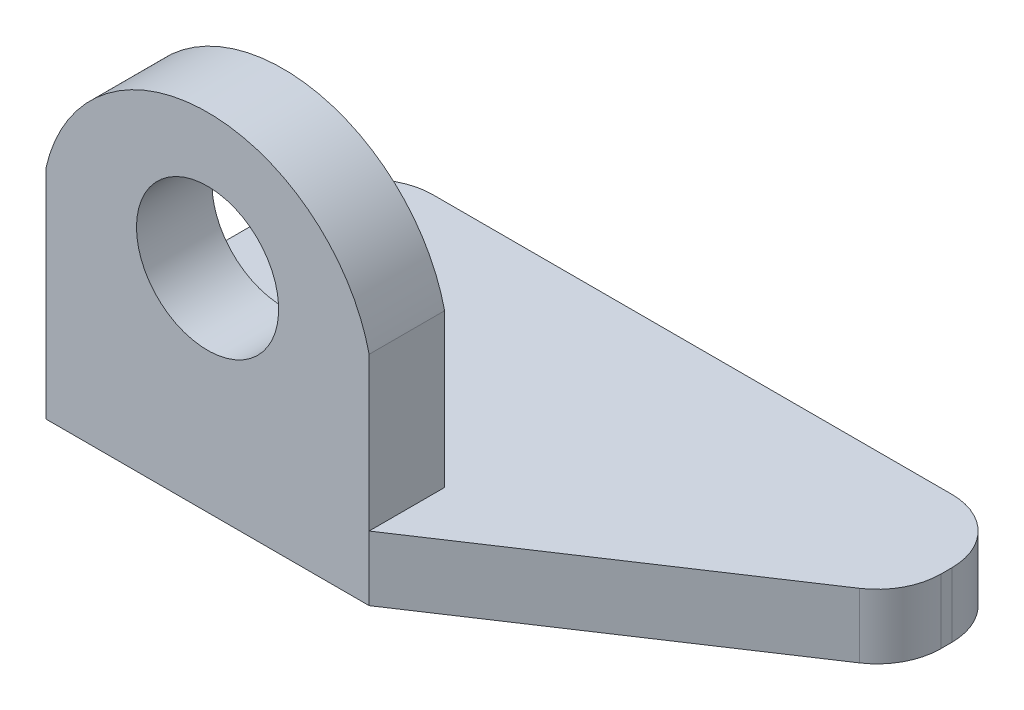
ISO-10303-21;
HEADER;
FILE_DESCRIPTION(('STEP AP214'),'2;1');
FILE_NAME('part.step','',(''),(''),'','','');
FILE_SCHEMA(('AUTOMOTIVE_DESIGN { 1 0 10303 214 1 1 1 1 }'));
ENDSEC;
DATA;
#1=APPLICATION_CONTEXT('core data for automotive mechanical design processes');
#2=APPLICATION_PROTOCOL_DEFINITION('international standard','automotive_design',2000,#1);
#3=PRODUCT_CONTEXT('',#1,'mechanical');
#4=PRODUCT('Part','Part','',(#3));
#5=PRODUCT_RELATED_PRODUCT_CATEGORY('part','',(#4));
#6=PRODUCT_DEFINITION_FORMATION('','',#4);
#7=PRODUCT_DEFINITION_CONTEXT('part definition',#1,'design');
#8=PRODUCT_DEFINITION('design','',#6,#7);
#9=PRODUCT_DEFINITION_SHAPE('','',#8);
#10=(LENGTH_UNIT() NAMED_UNIT(*) SI_UNIT(.MILLI.,.METRE.));
#11=(NAMED_UNIT(*) PLANE_ANGLE_UNIT() SI_UNIT($,.RADIAN.));
#12=(NAMED_UNIT(*) SI_UNIT($,.STERADIAN.) SOLID_ANGLE_UNIT());
#13=UNCERTAINTY_MEASURE_WITH_UNIT(LENGTH_MEASURE(1.E-05),#10,'distance_accuracy_value','');
#14=(GEOMETRIC_REPRESENTATION_CONTEXT(3) GLOBAL_UNCERTAINTY_ASSIGNED_CONTEXT((#13)) GLOBAL_UNIT_ASSIGNED_CONTEXT((#10,
#11,#12)) REPRESENTATION_CONTEXT('',''));
#15=CARTESIAN_POINT('',(0.,0.,0.));
#16=DIRECTION('',(0.,0.,1.));
#17=DIRECTION('',(1.,0.,0.));
#18=AXIS2_PLACEMENT_3D('',#15,#16,#17);
#19=CARTESIAN_POINT('',(0.,10.16,0.));
#20=DIRECTION('',(0.,1.,0.));
#21=DIRECTION('',(0.,0.,1.));
#22=AXIS2_PLACEMENT_3D('',#19,#20,#21);
#23=PLANE('',#22);
#24=DIRECTION('',(1.,0.,0.));
#25=VECTOR('',#24,1.);
#26=CARTESIAN_POINT('',(0.,10.16,-38.9370998116761));
#27=LINE('',#26,#25);
#28=CARTESIAN_POINT('',(-53.4459299037248,10.16,-38.9370998116761));
#29=VERTEX_POINT('',#28);
#30=CARTESIAN_POINT('',(28.1540700962752,10.16,-38.9370998116761));
#31=VERTEX_POINT('',#30);
#32=EDGE_CURVE('E162',#29,#31,#27,.T.);
#33=ORIENTED_EDGE('',*,*,#32,.F.);
#34=CARTESIAN_POINT('',(-53.4459299037248,10.16,-28.9370998116761));
#35=DIRECTION('',(0.,1.,0.));
#36=DIRECTION('',(0.,0.,1.));
#37=AXIS2_PLACEMENT_3D('',#34,#35,#36);
#38=CIRCLE('',#37,10.);
#39=CARTESIAN_POINT('',(-63.4459299037248,10.16,-28.9370998116761));
#40=VERTEX_POINT('',#39);
#41=EDGE_CURVE('E11',#29,#40,#38,.T.);
#42=ORIENTED_EDGE('',*,*,#41,.T.);
#43=DIRECTION('',(0.,0.,-1.));
#44=VECTOR('',#43,1.);
#45=CARTESIAN_POINT('',(-63.4459299037248,10.16,0.));
#46=LINE('',#45,#44);
#47=CARTESIAN_POINT('',(-63.4459299037248,10.16,0.));
#48=VERTEX_POINT('',#47);
#49=EDGE_CURVE('E123',#48,#40,#46,.T.);
#50=ORIENTED_EDGE('',*,*,#49,.F.);
#51=DIRECTION('',(1.,0.,0.));
#52=VECTOR('',#51,1.);
#53=CARTESIAN_POINT('',(0.,10.16,0.));
#54=LINE('',#53,#52);
#55=CARTESIAN_POINT('',(-12.6459299037248,10.16,0.));
#56=VERTEX_POINT('',#55);
#57=EDGE_CURVE('E133',#48,#56,#54,.T.);
#58=ORIENTED_EDGE('',*,*,#57,.T.);
#59=DIRECTION('',(0.,0.,-1.));
#60=VECTOR('',#59,1.);
#61=CARTESIAN_POINT('',(-12.6459299037248,10.16,79.2752736150791));
#62=LINE('',#61,#60);
#63=CARTESIAN_POINT('',(-12.6459299037248,10.16,11.8629001883239));
#64=VERTEX_POINT('',#63);
#65=EDGE_CURVE('E152',#64,#56,#62,.T.);
#66=ORIENTED_EDGE('',*,*,#65,.F.);
#67=DIRECTION('',(0.833279049312413,0.,-0.552852625911284));
#68=VECTOR('',#67,1.);
#69=CARTESIAN_POINT('',(1.59982869525708,10.16,2.41131844503613));
#70=LINE('',#69,#68);
#71=CARTESIAN_POINT('',(33.682596355388,10.16,-18.8745189488607));
#72=VERTEX_POINT('',#71);
#73=EDGE_CURVE('E156',#64,#72,#70,.T.);
#74=ORIENTED_EDGE('',*,*,#73,.T.);
#75=CARTESIAN_POINT('',(28.1540700962752,10.16,-27.2073094419849));
#76=DIRECTION('',(0.,1.,0.));
#77=DIRECTION('',(0.,0.,1.));
#78=AXIS2_PLACEMENT_3D('',#75,#76,#77);
#79=CIRCLE('',#78,10.);
#80=CARTESIAN_POINT('',(38.1540700962752,10.16,-27.2073094419849));
#81=VERTEX_POINT('',#80);
#82=EDGE_CURVE('E193',#72,#81,#79,.T.);
#83=ORIENTED_EDGE('',*,*,#82,.T.);
#84=DIRECTION('',(0.,0.,1.));
#85=VECTOR('',#84,1.);
#86=CARTESIAN_POINT('',(38.1540700962752,10.16,0.));
#87=LINE('',#86,#85);
#88=CARTESIAN_POINT('',(38.1540700962752,10.16,-28.9370998116761));
#89=VERTEX_POINT('',#88);
#90=EDGE_CURVE('E159',#89,#81,#87,.T.);
#91=ORIENTED_EDGE('',*,*,#90,.F.);
#92=CARTESIAN_POINT('',(28.1540700962752,10.16,-28.9370998116761));
#93=DIRECTION('',(0.,1.,0.));
#94=DIRECTION('',(0.,0.,1.));
#95=AXIS2_PLACEMENT_3D('',#92,#93,#94);
#96=CIRCLE('',#95,10.);
#97=EDGE_CURVE('E183',#89,#31,#96,.T.);
#98=ORIENTED_EDGE('',*,*,#97,.T.);
#99=EDGE_LOOP('',(#33,#42,#50,#58,#66,#74,#83,#91,#98));
#100=FACE_BOUND('',#99,.T.);
#101=ADVANCED_FACE('F32',(#100),#23,.T.);
#102=CARTESIAN_POINT('',(0.,10.16,11.8629001883239));
#103=DIRECTION('',(0.,0.,1.));
#104=DIRECTION('',(1.,0.,0.));
#105=AXIS2_PLACEMENT_3D('',#102,#103,#104);
#106=PLANE('',#105);
#107=CARTESIAN_POINT('',(-38.0459299037249,33.2379234900602,11.8629001883239));
#108=DIRECTION('',(0.,0.,-1.));
#109=DIRECTION('',(-1.,0.,0.));
#110=AXIS2_PLACEMENT_3D('',#107,#108,#109);
#111=CIRCLE('',#110,11.176966961914);
#112=CARTESIAN_POINT('',(-49.2228968656389,33.2379234900602,11.8629001883239));
#113=VERTEX_POINT('',#112);
#114=EDGE_CURVE('E140',#113,#113,#111,.T.);
#115=ORIENTED_EDGE('',*,*,#114,.T.);
#116=EDGE_LOOP('',(#115));
#117=FACE_BOUND('',#116,.T.);
#118=DIRECTION('',(-1.,0.,0.));
#119=VECTOR('',#118,1.);
#120=CARTESIAN_POINT('',(0.,0.,11.8629001883239));
#121=LINE('',#120,#119);
#122=CARTESIAN_POINT('',(-12.6459299037248,0.,11.8629001883239));
#123=VERTEX_POINT('',#122);
#124=CARTESIAN_POINT('',(-63.4459299037248,0.,11.8629001883239));
#125=VERTEX_POINT('',#124);
#126=EDGE_CURVE('E149',#123,#125,#121,.T.);
#127=ORIENTED_EDGE('',*,*,#126,.F.);
#128=DIRECTION('',(0.,-1.,0.));
#129=VECTOR('',#128,1.);
#130=CARTESIAN_POINT('',(-12.6459299037248,10.16,11.8629001883239));
#131=LINE('',#130,#129);
#132=EDGE_CURVE('E122',#64,#123,#131,.T.);
#133=ORIENTED_EDGE('',*,*,#132,.F.);
#134=DIRECTION('',(0.,1.,0.));
#135=VECTOR('',#134,1.);
#136=CARTESIAN_POINT('',(-12.6459299037248,0.,11.8629001883239));
#137=LINE('',#136,#135);
#138=CARTESIAN_POINT('',(-12.6459299037248,34.2244860125212,11.8629001883239));
#139=VERTEX_POINT('',#138);
#140=EDGE_CURVE('E139',#64,#139,#137,.T.);
#141=ORIENTED_EDGE('',*,*,#140,.T.);
#142=CARTESIAN_POINT('',(-38.0459299037248,28.4198188154215,11.8629001883239));
#143=DIRECTION('',(0.,0.,1.));
#144=DIRECTION('',(1.,0.,0.));
#145=AXIS2_PLACEMENT_3D('',#142,#143,#144);
#146=CIRCLE('',#145,26.0548299029006);
#147=CARTESIAN_POINT('',(-63.4459299037248,34.2244860125212,11.8629001883239));
#148=VERTEX_POINT('',#147);
#149=EDGE_CURVE('E128',#148,#139,#146,.F.);
#150=ORIENTED_EDGE('',*,*,#149,.F.);
#151=DIRECTION('',(0.,-1.,0.));
#152=VECTOR('',#151,1.);
#153=CARTESIAN_POINT('',(-63.4459299037248,10.16,11.8629001883239));
#154=LINE('',#153,#152);
#155=EDGE_CURVE('E109',#148,#125,#154,.T.);
#156=ORIENTED_EDGE('',*,*,#155,.T.);
#157=EDGE_LOOP('',(#127,#133,#141,#150,#156));
#158=FACE_BOUND('',#157,.T.);
#159=ADVANCED_FACE('F136',(#117,#158),#106,.T.);
#160=CARTESIAN_POINT('',(1.59982869525708,10.16,2.41131844503613));
#161=DIRECTION('',(-0.552852625911284,0.,-0.833279049312413));
#162=DIRECTION('',(-0.833279049312413,0.,0.552852625911284));
#163=AXIS2_PLACEMENT_3D('',#160,#161,#162);
#164=PLANE('',#163);
#165=DIRECTION('',(0.833279049312413,0.,-0.552852625911284));
#166=VECTOR('',#165,1.);
#167=CARTESIAN_POINT('',(1.59982869525708,0.,2.41131844503613));
#168=LINE('',#167,#166);
#169=CARTESIAN_POINT('',(33.682596355388,0.,-18.8745189488607));
#170=VERTEX_POINT('',#169);
#171=EDGE_CURVE('E166',#123,#170,#168,.T.);
#172=ORIENTED_EDGE('',*,*,#171,.T.);
#173=DIRECTION('',(0.,-1.,0.));
#174=VECTOR('',#173,1.);
#175=CARTESIAN_POINT('',(33.682596355388,10.16,-18.8745189488607));
#176=LINE('',#175,#174);
#177=EDGE_CURVE('E191',#170,#72,#176,.F.);
#178=ORIENTED_EDGE('',*,*,#177,.T.);
#179=ORIENTED_EDGE('',*,*,#73,.F.);
#180=ORIENTED_EDGE('',*,*,#132,.T.);
#181=EDGE_LOOP('',(#172,#178,#179,#180));
#182=FACE_BOUND('',#181,.T.);
#183=ADVANCED_FACE('F204',(#182),#164,.F.);
#184=CARTESIAN_POINT('',(38.1540700962752,10.16,0.));
#185=DIRECTION('',(1.,0.,0.));
#186=DIRECTION('',(0.,0.,-1.));
#187=AXIS2_PLACEMENT_3D('',#184,#185,#186);
#188=PLANE('',#187);
#189=ORIENTED_EDGE('',*,*,#90,.T.);
#190=DIRECTION('',(0.,-1.,0.));
#191=VECTOR('',#190,1.);
#192=CARTESIAN_POINT('',(38.1540700962752,0.,-27.2073094419849));
#193=LINE('',#192,#191);
#194=CARTESIAN_POINT('',(38.1540700962752,0.,-27.2073094419849));
#195=VERTEX_POINT('',#194);
#196=EDGE_CURVE('E186',#81,#195,#193,.T.);
#197=ORIENTED_EDGE('',*,*,#196,.T.);
#198=DIRECTION('',(0.,0.,1.));
#199=VECTOR('',#198,1.);
#200=CARTESIAN_POINT('',(38.1540700962752,0.,0.));
#201=LINE('',#200,#199);
#202=CARTESIAN_POINT('',(38.1540700962752,0.,-28.9370998116761));
#203=VERTEX_POINT('',#202);
#204=EDGE_CURVE('E169',#203,#195,#201,.T.);
#205=ORIENTED_EDGE('',*,*,#204,.F.);
#206=DIRECTION('',(0.,-1.,0.));
#207=VECTOR('',#206,1.);
#208=CARTESIAN_POINT('',(38.1540700962752,10.16,-28.9370998116761));
#209=LINE('',#208,#207);
#210=EDGE_CURVE('E181',#203,#89,#209,.F.);
#211=ORIENTED_EDGE('',*,*,#210,.T.);
#212=EDGE_LOOP('',(#189,#197,#205,#211));
#213=FACE_BOUND('',#212,.T.);
#214=ADVANCED_FACE('F249',(#213),#188,.T.);
#215=CARTESIAN_POINT('',(0.,10.16,-38.9370998116761));
#216=DIRECTION('',(0.,0.,-1.));
#217=DIRECTION('',(-1.,0.,0.));
#218=AXIS2_PLACEMENT_3D('',#215,#216,#217);
#219=PLANE('',#218);
#220=DIRECTION('',(1.,0.,0.));
#221=VECTOR('',#220,1.);
#222=CARTESIAN_POINT('',(0.,0.,-38.9370998116761));
#223=LINE('',#222,#221);
#224=CARTESIAN_POINT('',(-53.4459299037248,0.,-38.9370998116761));
#225=VERTEX_POINT('',#224);
#226=CARTESIAN_POINT('',(28.1540700962752,0.,-38.9370998116761));
#227=VERTEX_POINT('',#226);
#228=EDGE_CURVE('E172',#225,#227,#223,.T.);
#229=ORIENTED_EDGE('',*,*,#228,.F.);
#230=DIRECTION('',(0.,-1.,0.));
#231=VECTOR('',#230,1.);
#232=CARTESIAN_POINT('',(-53.4459299037248,10.16,-38.9370998116761));
#233=LINE('',#232,#231);
#234=EDGE_CURVE('E40',#225,#29,#233,.F.);
#235=ORIENTED_EDGE('',*,*,#234,.T.);
#236=ORIENTED_EDGE('',*,*,#32,.T.);
#237=DIRECTION('',(0.,-1.,0.));
#238=VECTOR('',#237,1.);
#239=CARTESIAN_POINT('',(28.1540700962752,10.16,-38.9370998116761));
#240=LINE('',#239,#238);
#241=EDGE_CURVE('E176',#31,#227,#240,.T.);
#242=ORIENTED_EDGE('',*,*,#241,.T.);
#243=EDGE_LOOP('',(#229,#235,#236,#242));
#244=FACE_BOUND('',#243,.T.);
#245=ADVANCED_FACE('F246',(#244),#219,.T.);
#246=CARTESIAN_POINT('',(-63.4459299037248,10.16,0.));
#247=DIRECTION('',(-1.,0.,0.));
#248=DIRECTION('',(0.,0.,1.));
#249=AXIS2_PLACEMENT_3D('',#246,#247,#248);
#250=PLANE('',#249);
#251=ORIENTED_EDGE('',*,*,#49,.T.);
#252=DIRECTION('',(0.,-1.,0.));
#253=VECTOR('',#252,1.);
#254=CARTESIAN_POINT('',(-63.4459299037248,10.16,-28.9370998116761));
#255=LINE('',#254,#253);
#256=CARTESIAN_POINT('',(-63.4459299037248,0.,-28.9370998116761));
#257=VERTEX_POINT('',#256);
#258=EDGE_CURVE('E195',#40,#257,#255,.T.);
#259=ORIENTED_EDGE('',*,*,#258,.T.);
#260=DIRECTION('',(0.,0.,-1.));
#261=VECTOR('',#260,1.);
#262=CARTESIAN_POINT('',(-63.4459299037248,0.,0.));
#263=LINE('',#262,#261);
#264=EDGE_CURVE('E117',#125,#257,#263,.T.);
#265=ORIENTED_EDGE('',*,*,#264,.F.);
#266=ORIENTED_EDGE('',*,*,#155,.F.);
#267=DIRECTION('',(0.,0.,-1.));
#268=VECTOR('',#267,1.);
#269=CARTESIAN_POINT('',(-63.4459299037248,34.2244860125212,79.2752736150791));
#270=LINE('',#269,#268);
#271=CARTESIAN_POINT('',(-63.4459299037248,34.2244860125212,0.));
#272=VERTEX_POINT('',#271);
#273=EDGE_CURVE('E114',#148,#272,#270,.T.);
#274=ORIENTED_EDGE('',*,*,#273,.T.);
#275=DIRECTION('',(0.,1.,0.));
#276=VECTOR('',#275,1.);
#277=CARTESIAN_POINT('',(-63.4459299037248,0.,0.));
#278=LINE('',#277,#276);
#279=EDGE_CURVE('E150',#48,#272,#278,.T.);
#280=ORIENTED_EDGE('',*,*,#279,.F.);
#281=EDGE_LOOP('',(#251,#259,#265,#266,#274,#280));
#282=FACE_BOUND('',#281,.T.);
#283=ADVANCED_FACE('F112',(#282),#250,.T.);
#284=CARTESIAN_POINT('',(0.,0.,0.));
#285=DIRECTION('',(0.,1.,0.));
#286=DIRECTION('',(0.,0.,1.));
#287=AXIS2_PLACEMENT_3D('',#284,#285,#286);
#288=PLANE('',#287);
#289=ORIENTED_EDGE('',*,*,#264,.T.);
#290=CARTESIAN_POINT('',(-53.4459299037248,0.,-28.9370998116761));
#291=DIRECTION('',(0.,1.,0.));
#292=DIRECTION('',(0.,0.,1.));
#293=AXIS2_PLACEMENT_3D('',#290,#291,#292);
#294=CIRCLE('',#293,10.);
#295=EDGE_CURVE('E54',#257,#225,#294,.F.);
#296=ORIENTED_EDGE('',*,*,#295,.T.);
#297=ORIENTED_EDGE('',*,*,#228,.T.);
#298=CARTESIAN_POINT('',(28.1540700962752,0.,-28.9370998116761));
#299=DIRECTION('',(0.,1.,0.));
#300=DIRECTION('',(0.,0.,1.));
#301=AXIS2_PLACEMENT_3D('',#298,#299,#300);
#302=CIRCLE('',#301,10.);
#303=EDGE_CURVE('E179',#227,#203,#302,.F.);
#304=ORIENTED_EDGE('',*,*,#303,.T.);
#305=ORIENTED_EDGE('',*,*,#204,.T.);
#306=CARTESIAN_POINT('',(28.1540700962752,0.,-27.2073094419849));
#307=DIRECTION('',(0.,1.,0.));
#308=DIRECTION('',(0.,0.,1.));
#309=AXIS2_PLACEMENT_3D('',#306,#307,#308);
#310=CIRCLE('',#309,10.);
#311=EDGE_CURVE('E189',#195,#170,#310,.F.);
#312=ORIENTED_EDGE('',*,*,#311,.T.);
#313=ORIENTED_EDGE('',*,*,#171,.F.);
#314=ORIENTED_EDGE('',*,*,#126,.T.);
#315=EDGE_LOOP('',(#289,#296,#297,#304,#305,#312,#313,#314));
#316=FACE_BOUND('',#315,.T.);
#317=ADVANCED_FACE('F200',(#316),#288,.F.);
#318=CARTESIAN_POINT('',(-38.0459299037248,28.4198188154215,79.2752736150791));
#319=DIRECTION('',(0.,0.,-1.));
#320=DIRECTION('',(-1.,0.,0.));
#321=AXIS2_PLACEMENT_3D('',#318,#319,#320);
#322=CYLINDRICAL_SURFACE('',#321,26.0548299029006);
#323=ORIENTED_EDGE('',*,*,#273,.F.);
#324=ORIENTED_EDGE('',*,*,#149,.T.);
#325=DIRECTION('',(0.,0.,-1.));
#326=VECTOR('',#325,1.);
#327=CARTESIAN_POINT('',(-12.6459299037248,34.2244860125212,79.2752736150791));
#328=LINE('',#327,#326);
#329=CARTESIAN_POINT('',(-12.6459299037248,34.2244860125212,0.));
#330=VERTEX_POINT('',#329);
#331=EDGE_CURVE('E134',#139,#330,#328,.T.);
#332=ORIENTED_EDGE('',*,*,#331,.T.);
#333=CARTESIAN_POINT('',(-38.0459299037248,28.4198188154215,0.));
#334=DIRECTION('',(0.,0.,1.));
#335=DIRECTION('',(1.,0.,0.));
#336=AXIS2_PLACEMENT_3D('',#333,#334,#335);
#337=CIRCLE('',#336,26.0548299029006);
#338=EDGE_CURVE('E131',#272,#330,#337,.F.);
#339=ORIENTED_EDGE('',*,*,#338,.F.);
#340=EDGE_LOOP('',(#323,#324,#332,#339));
#341=FACE_BOUND('',#340,.T.);
#342=ADVANCED_FACE('F127',(#341),#322,.T.);
#343=CARTESIAN_POINT('',(-12.6459299037248,0.,79.2752736150791));
#344=DIRECTION('',(-1.,0.,0.));
#345=DIRECTION('',(0.,0.,1.));
#346=AXIS2_PLACEMENT_3D('',#343,#344,#345);
#347=PLANE('',#346);
#348=ORIENTED_EDGE('',*,*,#140,.F.);
#349=ORIENTED_EDGE('',*,*,#65,.T.);
#350=DIRECTION('',(0.,1.,0.));
#351=VECTOR('',#350,1.);
#352=CARTESIAN_POINT('',(-12.6459299037248,0.,0.));
#353=LINE('',#352,#351);
#354=EDGE_CURVE('E154',#56,#330,#353,.T.);
#355=ORIENTED_EDGE('',*,*,#354,.T.);
#356=ORIENTED_EDGE('',*,*,#331,.F.);
#357=EDGE_LOOP('',(#348,#349,#355,#356));
#358=FACE_BOUND('',#357,.T.);
#359=ADVANCED_FACE('F209',(#358),#347,.F.);
#360=CARTESIAN_POINT('',(0.,0.,0.));
#361=DIRECTION('',(0.,0.,1.));
#362=DIRECTION('',(1.,0.,0.));
#363=AXIS2_PLACEMENT_3D('',#360,#361,#362);
#364=PLANE('',#363);
#365=CARTESIAN_POINT('',(-38.0459299037249,33.2379234900602,0.));
#366=DIRECTION('',(0.,0.,-1.));
#367=DIRECTION('',(-1.,0.,0.));
#368=AXIS2_PLACEMENT_3D('',#365,#366,#367);
#369=CIRCLE('',#368,11.176966961914);
#370=CARTESIAN_POINT('',(-49.2228968656389,33.2379234900602,0.));
#371=VERTEX_POINT('',#370);
#372=EDGE_CURVE('E144',#371,#371,#369,.T.);
#373=ORIENTED_EDGE('',*,*,#372,.F.);
#374=EDGE_LOOP('',(#373));
#375=FACE_BOUND('',#374,.T.);
#376=ORIENTED_EDGE('',*,*,#338,.T.);
#377=ORIENTED_EDGE('',*,*,#354,.F.);
#378=ORIENTED_EDGE('',*,*,#57,.F.);
#379=ORIENTED_EDGE('',*,*,#279,.T.);
#380=EDGE_LOOP('',(#376,#377,#378,#379));
#381=FACE_BOUND('',#380,.T.);
#382=ADVANCED_FACE('F215',(#375,#381),#364,.F.);
#383=CARTESIAN_POINT('',(-38.0459299037249,33.2379234900602,11.8629001883239));
#384=DIRECTION('',(0.,0.,-1.));
#385=DIRECTION('',(-1.,0.,0.));
#386=AXIS2_PLACEMENT_3D('',#383,#384,#385);
#387=CYLINDRICAL_SURFACE('',#386,11.176966961914);
#388=ORIENTED_EDGE('',*,*,#114,.F.);
#389=EDGE_LOOP('',(#388));
#390=FACE_BOUND('',#389,.T.);
#391=ORIENTED_EDGE('',*,*,#372,.T.);
#392=EDGE_LOOP('',(#391));
#393=FACE_BOUND('',#392,.T.);
#394=ADVANCED_FACE('F221',(#390,#393),#387,.F.);
#395=CARTESIAN_POINT('',(28.1540700962752,10.16,-28.9370998116761));
#396=DIRECTION('',(0.,-1.,0.));
#397=DIRECTION('',(0.,0.,-1.));
#398=AXIS2_PLACEMENT_3D('',#395,#396,#397);
#399=CYLINDRICAL_SURFACE('',#398,10.);
#400=ORIENTED_EDGE('',*,*,#97,.F.);
#401=ORIENTED_EDGE('',*,*,#210,.F.);
#402=ORIENTED_EDGE('',*,*,#303,.F.);
#403=ORIENTED_EDGE('',*,*,#241,.F.);
#404=EDGE_LOOP('',(#400,#401,#402,#403));
#405=FACE_BOUND('',#404,.T.);
#406=ADVANCED_FACE('F229',(#405),#399,.T.);
#407=CARTESIAN_POINT('',(28.1540700962752,10.16,-27.2073094419849));
#408=DIRECTION('',(0.,1.,0.));
#409=DIRECTION('',(0.,0.,1.));
#410=AXIS2_PLACEMENT_3D('',#407,#408,#409);
#411=CYLINDRICAL_SURFACE('',#410,10.);
#412=ORIENTED_EDGE('',*,*,#82,.F.);
#413=ORIENTED_EDGE('',*,*,#177,.F.);
#414=ORIENTED_EDGE('',*,*,#311,.F.);
#415=ORIENTED_EDGE('',*,*,#196,.F.);
#416=EDGE_LOOP('',(#412,#413,#414,#415));
#417=FACE_BOUND('',#416,.T.);
#418=ADVANCED_FACE('F256',(#417),#411,.T.);
#419=CARTESIAN_POINT('',(-53.4459299037248,10.16,-28.9370998116761));
#420=DIRECTION('',(0.,-1.,0.));
#421=DIRECTION('',(0.,0.,-1.));
#422=AXIS2_PLACEMENT_3D('',#419,#420,#421);
#423=CYLINDRICAL_SURFACE('',#422,10.);
#424=ORIENTED_EDGE('',*,*,#41,.F.);
#425=ORIENTED_EDGE('',*,*,#234,.F.);
#426=ORIENTED_EDGE('',*,*,#295,.F.);
#427=ORIENTED_EDGE('',*,*,#258,.F.);
#428=EDGE_LOOP('',(#424,#425,#426,#427));
#429=FACE_BOUND('',#428,.T.);
#430=ADVANCED_FACE('F34',(#429),#423,.T.);
#431=CLOSED_SHELL('',(#101,#159,#183,#214,#245,#283,#317,#342,#359,#382,#394,#406,#418,#430));
#432=MANIFOLD_SOLID_BREP('B2',#431);
#433=ADVANCED_BREP_SHAPE_REPRESENTATION('',(#18,#432),#14);
#434=SHAPE_DEFINITION_REPRESENTATION(#9,#433);
ENDSEC;
END-ISO-10303-21;
